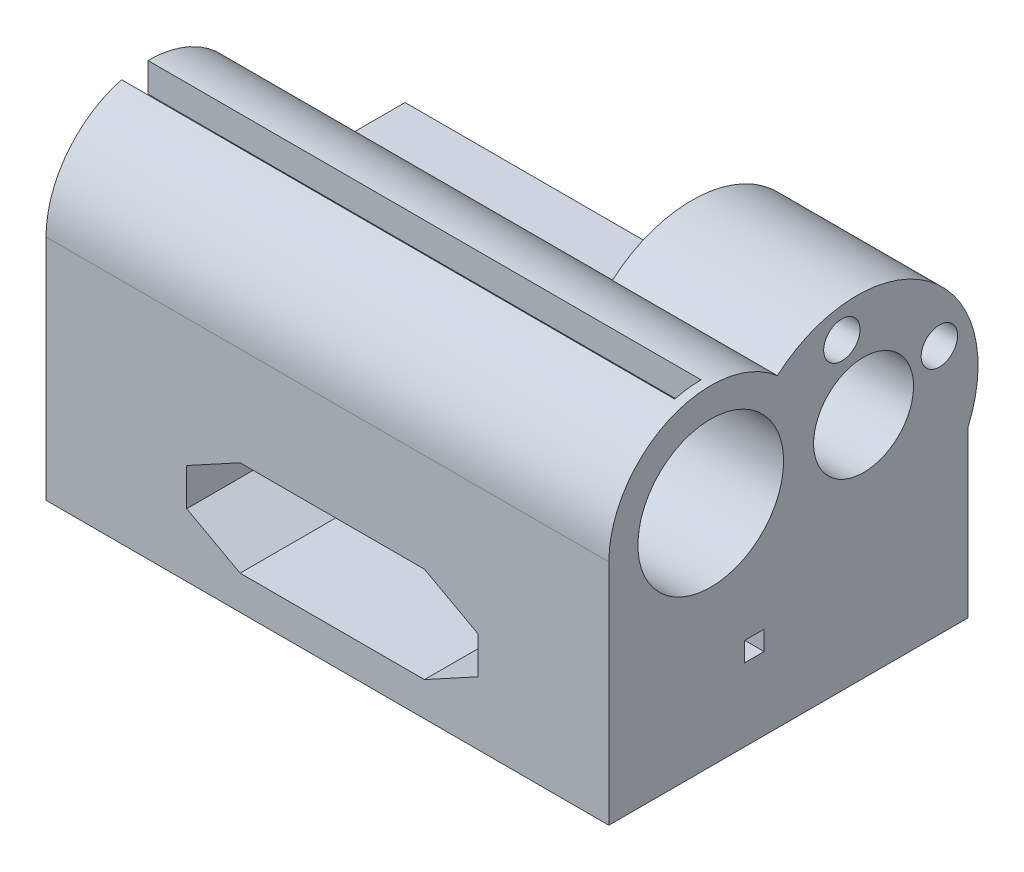
ISO-10303-21;
HEADER;
FILE_DESCRIPTION(('STEP AP214'),'2;1');
FILE_NAME('part.step','',(''),(''),'','','');
FILE_SCHEMA(('AUTOMOTIVE_DESIGN { 1 0 10303 214 1 1 1 1 }'));
ENDSEC;
DATA;
#1=APPLICATION_CONTEXT('core data for automotive mechanical design processes');
#2=APPLICATION_PROTOCOL_DEFINITION('international standard','automotive_design',2000,#1);
#3=PRODUCT_CONTEXT('',#1,'mechanical');
#4=PRODUCT('Part','Part','',(#3));
#5=PRODUCT_RELATED_PRODUCT_CATEGORY('part','',(#4));
#6=PRODUCT_DEFINITION_FORMATION('','',#4);
#7=PRODUCT_DEFINITION_CONTEXT('part definition',#1,'design');
#8=PRODUCT_DEFINITION('design','',#6,#7);
#9=PRODUCT_DEFINITION_SHAPE('','',#8);
#10=(LENGTH_UNIT() NAMED_UNIT(*) SI_UNIT(.MILLI.,.METRE.));
#11=(NAMED_UNIT(*) PLANE_ANGLE_UNIT() SI_UNIT($,.RADIAN.));
#12=(NAMED_UNIT(*) SI_UNIT($,.STERADIAN.) SOLID_ANGLE_UNIT());
#13=UNCERTAINTY_MEASURE_WITH_UNIT(LENGTH_MEASURE(1.E-05),#10,'distance_accuracy_value','');
#14=(GEOMETRIC_REPRESENTATION_CONTEXT(3) GLOBAL_UNCERTAINTY_ASSIGNED_CONTEXT((#13)) GLOBAL_UNIT_ASSIGNED_CONTEXT((#10,
#11,#12)) REPRESENTATION_CONTEXT('',''));
#15=CARTESIAN_POINT('',(0.,0.,0.));
#16=DIRECTION('',(0.,0.,1.));
#17=DIRECTION('',(1.,0.,0.));
#18=AXIS2_PLACEMENT_3D('',#15,#16,#17);
#19=CARTESIAN_POINT('',(29.,17.,18.5));
#20=DIRECTION('',(-1.,0.,0.));
#21=DIRECTION('',(0.,0.,1.));
#22=AXIS2_PLACEMENT_3D('',#19,#20,#21);
#23=PLANE('',#22);
#24=DIRECTION('',(0.,-1.,0.));
#25=VECTOR('',#24,1.);
#26=CARTESIAN_POINT('',(29.,17.,-18.5));
#27=LINE('',#26,#25);
#28=CARTESIAN_POINT('',(29.,17.,-18.5));
#29=VERTEX_POINT('',#28);
#30=CARTESIAN_POINT('',(29.,0.,-18.5));
#31=VERTEX_POINT('',#30);
#32=EDGE_CURVE('E442',#29,#31,#27,.T.);
#33=ORIENTED_EDGE('',*,*,#32,.F.);
#34=CARTESIAN_POINT('',(29.,22.,-7.04356076261039));
#35=DIRECTION('',(1.,0.,0.));
#36=DIRECTION('',(0.,0.,-1.));
#37=AXIS2_PLACEMENT_3D('',#34,#35,#36);
#38=CIRCLE('',#37,12.5);
#39=CARTESIAN_POINT('',(29.,31.4490069740523,1.1397311913841));
#40=VERTEX_POINT('',#39);
#41=EDGE_CURVE('E377',#29,#40,#38,.T.);
#42=ORIENTED_EDGE('',*,*,#41,.T.);
#43=CARTESIAN_POINT('',(29.,23.5,8.));
#44=DIRECTION('',(1.,0.,0.));
#45=DIRECTION('',(0.,0.,-1.));
#46=AXIS2_PLACEMENT_3D('',#43,#44,#45);
#47=CIRCLE('',#46,10.5);
#48=CARTESIAN_POINT('',(29.,23.5,18.5));
#49=VERTEX_POINT('',#48);
#50=EDGE_CURVE('E402',#40,#49,#47,.T.);
#51=ORIENTED_EDGE('',*,*,#50,.T.);
#52=DIRECTION('',(0.,-1.,0.));
#53=VECTOR('',#52,1.);
#54=CARTESIAN_POINT('',(29.,17.,18.5));
#55=LINE('',#54,#53);
#56=CARTESIAN_POINT('',(29.,0.,18.5));
#57=VERTEX_POINT('',#56);
#58=EDGE_CURVE('E425',#49,#57,#55,.T.);
#59=ORIENTED_EDGE('',*,*,#58,.T.);
#60=DIRECTION('',(0.,0.,-1.));
#61=VECTOR('',#60,1.);
#62=CARTESIAN_POINT('',(29.,0.,18.5));
#63=LINE('',#62,#61);
#64=EDGE_CURVE('E409',#57,#31,#63,.T.);
#65=ORIENTED_EDGE('',*,*,#64,.T.);
#66=EDGE_LOOP('',(#33,#42,#51,#59,#65));
#67=FACE_BOUND('',#66,.T.);
#68=CARTESIAN_POINT('',(29.,23.5,-7.7501439));
#69=DIRECTION('',(1.,0.,0.));
#70=DIRECTION('',(0.,0.,-1.));
#71=AXIS2_PLACEMENT_3D('',#68,#69,#70);
#72=CIRCLE('',#71,5.15);
#73=CARTESIAN_POINT('',(29.,23.5,-12.9001439));
#74=VERTEX_POINT('',#73);
#75=EDGE_CURVE('E311',#74,#74,#72,.T.);
#76=ORIENTED_EDGE('',*,*,#75,.F.);
#77=EDGE_LOOP('',(#76));
#78=FACE_BOUND('',#77,.T.);
#79=CARTESIAN_POINT('',(29.,23.5,8.));
#80=DIRECTION('',(1.,0.,0.));
#81=DIRECTION('',(0.,0.,-1.));
#82=AXIS2_PLACEMENT_3D('',#79,#80,#81);
#83=CIRCLE('',#82,7.5075);
#84=CARTESIAN_POINT('',(29.,23.5,0.492500000000002));
#85=VERTEX_POINT('',#84);
#86=EDGE_CURVE('E308',#85,#85,#83,.T.);
#87=ORIENTED_EDGE('',*,*,#86,.F.);
#88=EDGE_LOOP('',(#87));
#89=FACE_BOUND('',#88,.T.);
#90=CARTESIAN_POINT('',(29.,25.7404904729143,-15.5601264506066));
#91=DIRECTION('',(1.,0.,0.));
#92=DIRECTION('',(0.,0.,-1.));
#93=AXIS2_PLACEMENT_3D('',#90,#91,#92);
#94=CIRCLE('',#93,1.87500000000001);
#95=CARTESIAN_POINT('',(29.,25.7404904729143,-17.4351264506067));
#96=VERTEX_POINT('',#95);
#97=EDGE_CURVE('E297',#96,#96,#94,.T.);
#98=ORIENTED_EDGE('',*,*,#97,.F.);
#99=EDGE_LOOP('',(#98));
#100=FACE_BOUND('',#99,.T.);
#101=CARTESIAN_POINT('',(29.,31.3099825506067,-5.50965342708572));
#102=DIRECTION('',(1.,0.,0.));
#103=DIRECTION('',(0.,0.,-1.));
#104=AXIS2_PLACEMENT_3D('',#101,#102,#103);
#105=CIRCLE('',#104,1.875);
#106=CARTESIAN_POINT('',(29.,31.3099825506067,-7.38465342708572));
#107=VERTEX_POINT('',#106);
#108=EDGE_CURVE('E298',#107,#107,#105,.T.);
#109=ORIENTED_EDGE('',*,*,#108,.F.);
#110=EDGE_LOOP('',(#109));
#111=FACE_BOUND('',#110,.T.);
#112=DIRECTION('',(0.,1.,0.));
#113=VECTOR('',#112,1.);
#114=CARTESIAN_POINT('',(29.,7.5,4.5));
#115=LINE('',#114,#113);
#116=CARTESIAN_POINT('',(29.,7.5,4.5));
#117=VERTEX_POINT('',#116);
#118=CARTESIAN_POINT('',(29.,9.5,4.5));
#119=VERTEX_POINT('',#118);
#120=EDGE_CURVE('E61',#117,#119,#115,.T.);
#121=ORIENTED_EDGE('',*,*,#120,.T.);
#122=DIRECTION('',(0.,0.,-1.));
#123=VECTOR('',#122,1.);
#124=CARTESIAN_POINT('',(29.,9.5,4.5));
#125=LINE('',#124,#123);
#126=CARTESIAN_POINT('',(29.,9.5,2.5));
#127=VERTEX_POINT('',#126);
#128=EDGE_CURVE('E256',#119,#127,#125,.T.);
#129=ORIENTED_EDGE('',*,*,#128,.T.);
#130=DIRECTION('',(0.,-1.,0.));
#131=VECTOR('',#130,1.);
#132=CARTESIAN_POINT('',(29.,7.5,2.5));
#133=LINE('',#132,#131);
#134=CARTESIAN_POINT('',(29.,7.5,2.5));
#135=VERTEX_POINT('',#134);
#136=EDGE_CURVE('E253',#127,#135,#133,.T.);
#137=ORIENTED_EDGE('',*,*,#136,.T.);
#138=DIRECTION('',(0.,0.,1.));
#139=VECTOR('',#138,1.);
#140=CARTESIAN_POINT('',(29.,7.5,4.5));
#141=LINE('',#140,#139);
#142=EDGE_CURVE('E249',#135,#117,#141,.T.);
#143=ORIENTED_EDGE('',*,*,#142,.T.);
#144=EDGE_LOOP('',(#121,#129,#137,#143));
#145=FACE_BOUND('',#144,.T.);
#146=ADVANCED_FACE('F38',(#67,#78,#89,#100,#111,#145),#23,.F.);
#147=CARTESIAN_POINT('',(23.,8.5,4.5));
#148=DIRECTION('',(0.,0.,-1.));
#149=DIRECTION('',(-1.,0.,0.));
#150=AXIS2_PLACEMENT_3D('',#147,#148,#149);
#151=CYLINDRICAL_SURFACE('',#150,4.076);
#152=CARTESIAN_POINT('',(23.,8.5,-18.5));
#153=DIRECTION('',(0.,0.,-1.));
#154=DIRECTION('',(-1.,0.,0.));
#155=AXIS2_PLACEMENT_3D('',#152,#153,#154);
#156=CIRCLE('',#155,4.076);
#157=CARTESIAN_POINT('',(18.924,8.5,-18.5));
#158=VERTEX_POINT('',#157);
#159=EDGE_CURVE('E319',#158,#158,#156,.T.);
#160=ORIENTED_EDGE('',*,*,#159,.T.);
#161=EDGE_LOOP('',(#160));
#162=FACE_BOUND('',#161,.T.);
#163=DIRECTION('',(0.,0.,-1.));
#164=VECTOR('',#163,1.);
#165=CARTESIAN_POINT('',(26.9514270839787,9.5,4.5));
#166=LINE('',#165,#164);
#167=CARTESIAN_POINT('',(26.9514270839787,9.5,4.5));
#168=VERTEX_POINT('',#167);
#169=CARTESIAN_POINT('',(26.9514270839787,9.5,2.5));
#170=VERTEX_POINT('',#169);
#171=EDGE_CURVE('E269',#168,#170,#166,.T.);
#172=ORIENTED_EDGE('',*,*,#171,.F.);
#173=CARTESIAN_POINT('',(23.,8.5,4.5));
#174=DIRECTION('',(0.,0.,-1.));
#175=DIRECTION('',(-1.,0.,0.));
#176=AXIS2_PLACEMENT_3D('',#173,#174,#175);
#177=CIRCLE('',#176,4.076);
#178=CARTESIAN_POINT('',(26.9514270839787,7.5,4.5));
#179=VERTEX_POINT('',#178);
#180=EDGE_CURVE('E315',#179,#168,#177,.T.);
#181=ORIENTED_EDGE('',*,*,#180,.F.);
#182=DIRECTION('',(0.,0.,-1.));
#183=VECTOR('',#182,1.);
#184=CARTESIAN_POINT('',(26.9514270839787,7.5,4.5));
#185=LINE('',#184,#183);
#186=CARTESIAN_POINT('',(26.9514270839787,7.5,2.5));
#187=VERTEX_POINT('',#186);
#188=EDGE_CURVE('E262',#187,#179,#185,.F.);
#189=ORIENTED_EDGE('',*,*,#188,.F.);
#190=CARTESIAN_POINT('',(23.,8.5,2.5));
#191=DIRECTION('',(0.,0.,1.));
#192=DIRECTION('',(1.,0.,0.));
#193=AXIS2_PLACEMENT_3D('',#190,#191,#192);
#194=CIRCLE('',#193,4.076);
#195=EDGE_CURVE('E12',#170,#187,#194,.F.);
#196=ORIENTED_EDGE('',*,*,#195,.F.);
#197=EDGE_LOOP('',(#172,#181,#189,#196));
#198=FACE_BOUND('',#197,.T.);
#199=ADVANCED_FACE('F523',(#162,#198),#151,.F.);
#200=CARTESIAN_POINT('',(0.,17.,0.));
#201=DIRECTION('',(0.,-1.,0.));
#202=DIRECTION('',(0.,0.,-1.));
#203=AXIS2_PLACEMENT_3D('',#200,#201,#202);
#204=PLANE('',#203);
#205=CARTESIAN_POINT('',(0.500000000000004,17.,-11.5));
#206=DIRECTION('',(0.,-1.,0.));
#207=DIRECTION('',(0.,0.,-1.));
#208=AXIS2_PLACEMENT_3D('',#205,#206,#207);
#209=CIRCLE('',#208,1.5);
#210=CARTESIAN_POINT('',(0.500000000000004,17.,-13.));
#211=VERTEX_POINT('',#210);
#212=EDGE_CURVE('E917',#211,#211,#209,.T.);
#213=ORIENTED_EDGE('',*,*,#212,.T.);
#214=EDGE_LOOP('',(#213));
#215=FACE_BOUND('',#214,.T.);
#216=DIRECTION('',(0.,0.,1.));
#217=VECTOR('',#216,1.);
#218=CARTESIAN_POINT('',(12.,17.,0.));
#219=LINE('',#218,#217);
#220=CARTESIAN_POINT('',(12.,17.,-18.5));
#221=VERTEX_POINT('',#220);
#222=CARTESIAN_POINT('',(12.,17.,-2.5));
#223=VERTEX_POINT('',#222);
#224=EDGE_CURVE('E400',#221,#223,#219,.T.);
#225=ORIENTED_EDGE('',*,*,#224,.F.);
#226=DIRECTION('',(-1.,0.,0.));
#227=VECTOR('',#226,1.);
#228=CARTESIAN_POINT('',(-29.,17.,-18.5));
#229=LINE('',#228,#227);
#230=CARTESIAN_POINT('',(-29.,17.,-18.5));
#231=VERTEX_POINT('',#230);
#232=EDGE_CURVE('E422',#221,#231,#229,.T.);
#233=ORIENTED_EDGE('',*,*,#232,.T.);
#234=DIRECTION('',(0.,0.,1.));
#235=VECTOR('',#234,1.);
#236=CARTESIAN_POINT('',(-29.,17.,18.5));
#237=LINE('',#236,#235);
#238=CARTESIAN_POINT('',(-29.,17.,-2.5));
#239=VERTEX_POINT('',#238);
#240=EDGE_CURVE('E421',#231,#239,#237,.T.);
#241=ORIENTED_EDGE('',*,*,#240,.T.);
#242=DIRECTION('',(1.,0.,0.));
#243=VECTOR('',#242,1.);
#244=CARTESIAN_POINT('',(-56.0185121722126,17.,-2.5));
#245=LINE('',#244,#243);
#246=EDGE_CURVE('E414',#239,#223,#245,.T.);
#247=ORIENTED_EDGE('',*,*,#246,.T.);
#248=EDGE_LOOP('',(#225,#233,#241,#247));
#249=FACE_BOUND('',#248,.T.);
#250=ADVANCED_FACE('F510',(#215,#249),#204,.F.);
#251=CARTESIAN_POINT('',(-56.0185121722126,23.5,-2.5));
#252=DIRECTION('',(0.,0.,-1.));
#253=DIRECTION('',(-1.,0.,0.));
#254=AXIS2_PLACEMENT_3D('',#251,#252,#253);
#255=PLANE('',#254);
#256=DIRECTION('',(1.,0.,0.));
#257=VECTOR('',#256,1.);
#258=CARTESIAN_POINT('',(-56.0185121722126,23.5,-2.5));
#259=LINE('',#258,#257);
#260=CARTESIAN_POINT('',(-29.,23.5,-2.5));
#261=VERTEX_POINT('',#260);
#262=CARTESIAN_POINT('',(12.,23.5,-2.5));
#263=VERTEX_POINT('',#262);
#264=EDGE_CURVE('E405',#261,#263,#259,.T.);
#265=ORIENTED_EDGE('',*,*,#264,.T.);
#266=DIRECTION('',(0.,-1.,0.));
#267=VECTOR('',#266,1.);
#268=CARTESIAN_POINT('',(12.,23.5,-2.5));
#269=LINE('',#268,#267);
#270=EDGE_CURVE('E445',#263,#223,#269,.T.);
#271=ORIENTED_EDGE('',*,*,#270,.T.);
#272=ORIENTED_EDGE('',*,*,#246,.F.);
#273=DIRECTION('',(0.,-1.,0.));
#274=VECTOR('',#273,1.);
#275=CARTESIAN_POINT('',(-29.,23.5,-2.5));
#276=LINE('',#275,#274);
#277=EDGE_CURVE('E403',#261,#239,#276,.T.);
#278=ORIENTED_EDGE('',*,*,#277,.F.);
#279=EDGE_LOOP('',(#265,#271,#272,#278));
#280=FACE_BOUND('',#279,.T.);
#281=ADVANCED_FACE('F515',(#280),#255,.T.);
#282=CARTESIAN_POINT('',(-29.,17.,-18.5));
#283=DIRECTION('',(0.,0.,1.));
#284=DIRECTION('',(1.,0.,0.));
#285=AXIS2_PLACEMENT_3D('',#282,#283,#284);
#286=PLANE('',#285);
#287=ORIENTED_EDGE('',*,*,#159,.F.);
#288=EDGE_LOOP('',(#287));
#289=FACE_BOUND('',#288,.T.);
#290=CARTESIAN_POINT('',(-22.,8.5,-18.5));
#291=DIRECTION('',(0.,0.,-1.));
#292=DIRECTION('',(-1.,0.,0.));
#293=AXIS2_PLACEMENT_3D('',#290,#291,#292);
#294=CIRCLE('',#293,4.076);
#295=CARTESIAN_POINT('',(-26.076,8.5,-18.5));
#296=VERTEX_POINT('',#295);
#297=EDGE_CURVE('E325',#296,#296,#294,.T.);
#298=ORIENTED_EDGE('',*,*,#297,.F.);
#299=EDGE_LOOP('',(#298));
#300=FACE_BOUND('',#299,.T.);
#301=DIRECTION('',(-1.,0.,0.));
#302=VECTOR('',#301,1.);
#303=CARTESIAN_POINT('',(-8.99999999999999,3.5,-18.5));
#304=LINE('',#303,#302);
#305=CARTESIAN_POINT('',(10.,3.5,-18.5));
#306=VERTEX_POINT('',#305);
#307=CARTESIAN_POINT('',(-8.99999999999999,3.5,-18.5));
#308=VERTEX_POINT('',#307);
#309=EDGE_CURVE('E355',#306,#308,#304,.T.);
#310=ORIENTED_EDGE('',*,*,#309,.F.);
#311=DIRECTION('',(-0.877895572914384,-0.478852130680573,0.));
#312=VECTOR('',#311,1.);
#313=CARTESIAN_POINT('',(10.,3.5,-18.5));
#314=LINE('',#313,#312);
#315=CARTESIAN_POINT('',(15.5,6.5,-18.5));
#316=VERTEX_POINT('',#315);
#317=EDGE_CURVE('E318',#316,#306,#314,.T.);
#318=ORIENTED_EDGE('',*,*,#317,.F.);
#319=DIRECTION('',(0.,-1.,0.));
#320=VECTOR('',#319,1.);
#321=CARTESIAN_POINT('',(15.5,6.5,-18.5));
#322=LINE('',#321,#320);
#323=CARTESIAN_POINT('',(15.5,10.35,-18.5));
#324=VERTEX_POINT('',#323);
#325=EDGE_CURVE('E332',#324,#316,#322,.T.);
#326=ORIENTED_EDGE('',*,*,#325,.F.);
#327=DIRECTION('',(0.877895572914384,-0.478852130680573,0.));
#328=VECTOR('',#327,1.);
#329=CARTESIAN_POINT('',(15.5,10.35,-18.5));
#330=LINE('',#329,#328);
#331=CARTESIAN_POINT('',(10.,13.35,-18.5));
#332=VERTEX_POINT('',#331);
#333=EDGE_CURVE('E370',#332,#324,#330,.T.);
#334=ORIENTED_EDGE('',*,*,#333,.F.);
#335=DIRECTION('',(1.,0.,0.));
#336=VECTOR('',#335,1.);
#337=CARTESIAN_POINT('',(10.,13.35,-18.5));
#338=LINE('',#337,#336);
#339=CARTESIAN_POINT('',(-9.00000000000001,13.35,-18.5));
#340=VERTEX_POINT('',#339);
#341=EDGE_CURVE('E367',#340,#332,#338,.T.);
#342=ORIENTED_EDGE('',*,*,#341,.F.);
#343=DIRECTION('',(0.878365103433168,0.477990319013723,0.));
#344=VECTOR('',#343,1.);
#345=CARTESIAN_POINT('',(-9.00000000000001,13.35,-18.5));
#346=LINE('',#345,#344);
#347=CARTESIAN_POINT('',(-14.5,10.357,-18.5));
#348=VERTEX_POINT('',#347);
#349=EDGE_CURVE('E364',#348,#340,#346,.T.);
#350=ORIENTED_EDGE('',*,*,#349,.F.);
#351=DIRECTION('',(0.,1.,0.));
#352=VECTOR('',#351,1.);
#353=CARTESIAN_POINT('',(-14.5,10.357,-18.5));
#354=LINE('',#353,#352);
#355=CARTESIAN_POINT('',(-14.5,6.5,-18.5));
#356=VERTEX_POINT('',#355);
#357=EDGE_CURVE('E361',#356,#348,#354,.T.);
#358=ORIENTED_EDGE('',*,*,#357,.F.);
#359=DIRECTION('',(-0.877895572914384,0.478852130680573,0.));
#360=VECTOR('',#359,1.);
#361=CARTESIAN_POINT('',(-14.5,6.5,-18.5));
#362=LINE('',#361,#360);
#363=EDGE_CURVE('E358',#308,#356,#362,.T.);
#364=ORIENTED_EDGE('',*,*,#363,.F.);
#365=EDGE_LOOP('',(#310,#318,#326,#334,#342,#350,#358,#364));
#366=FACE_BOUND('',#365,.T.);
#367=DIRECTION('',(-1.,0.,0.));
#368=VECTOR('',#367,1.);
#369=CARTESIAN_POINT('',(-29.,0.,-18.5));
#370=LINE('',#369,#368);
#371=CARTESIAN_POINT('',(-29.,0.,-18.5));
#372=VERTEX_POINT('',#371);
#373=EDGE_CURVE('E428',#31,#372,#370,.T.);
#374=ORIENTED_EDGE('',*,*,#373,.T.);
#375=DIRECTION('',(0.,-1.,0.));
#376=VECTOR('',#375,1.);
#377=CARTESIAN_POINT('',(-29.,17.,-18.5));
#378=LINE('',#377,#376);
#379=EDGE_CURVE('E439',#231,#372,#378,.T.);
#380=ORIENTED_EDGE('',*,*,#379,.F.);
#381=ORIENTED_EDGE('',*,*,#232,.F.);
#382=EDGE_CURVE('E419',#29,#221,#229,.T.);
#383=ORIENTED_EDGE('',*,*,#382,.F.);
#384=ORIENTED_EDGE('',*,*,#32,.T.);
#385=EDGE_LOOP('',(#374,#380,#381,#383,#384));
#386=FACE_BOUND('',#385,.T.);
#387=ADVANCED_FACE('F481',(#289,#300,#366,#386),#286,.F.);
#388=CARTESIAN_POINT('',(-29.,17.,18.5));
#389=DIRECTION('',(1.,0.,0.));
#390=DIRECTION('',(0.,0.,-1.));
#391=AXIS2_PLACEMENT_3D('',#388,#389,#390);
#392=PLANE('',#391);
#393=DIRECTION('',(0.,0.,-1.));
#394=VECTOR('',#393,1.);
#395=CARTESIAN_POINT('',(-29.,9.5,4.5));
#396=LINE('',#395,#394);
#397=CARTESIAN_POINT('',(-29.,9.5,4.5));
#398=VERTEX_POINT('',#397);
#399=CARTESIAN_POINT('',(-29.,9.5,2.5));
#400=VERTEX_POINT('',#399);
#401=EDGE_CURVE('E273',#398,#400,#396,.T.);
#402=ORIENTED_EDGE('',*,*,#401,.F.);
#403=DIRECTION('',(0.,1.,0.));
#404=VECTOR('',#403,1.);
#405=CARTESIAN_POINT('',(-29.,7.5,4.5));
#406=LINE('',#405,#404);
#407=CARTESIAN_POINT('',(-29.,7.5,4.5));
#408=VERTEX_POINT('',#407);
#409=EDGE_CURVE('E271',#408,#398,#406,.T.);
#410=ORIENTED_EDGE('',*,*,#409,.F.);
#411=DIRECTION('',(0.,0.,1.));
#412=VECTOR('',#411,1.);
#413=CARTESIAN_POINT('',(-29.,7.5,4.5));
#414=LINE('',#413,#412);
#415=CARTESIAN_POINT('',(-29.,7.5,2.5));
#416=VERTEX_POINT('',#415);
#417=EDGE_CURVE('E279',#416,#408,#414,.T.);
#418=ORIENTED_EDGE('',*,*,#417,.F.);
#419=DIRECTION('',(0.,-1.,0.));
#420=VECTOR('',#419,1.);
#421=CARTESIAN_POINT('',(-29.,7.5,2.5));
#422=LINE('',#421,#420);
#423=EDGE_CURVE('E276',#400,#416,#422,.T.);
#424=ORIENTED_EDGE('',*,*,#423,.F.);
#425=EDGE_LOOP('',(#402,#410,#418,#424));
#426=FACE_BOUND('',#425,.T.);
#427=CARTESIAN_POINT('',(-29.,23.5,8.));
#428=DIRECTION('',(1.,0.,0.));
#429=DIRECTION('',(0.,0.,-1.));
#430=AXIS2_PLACEMENT_3D('',#427,#428,#429);
#431=CIRCLE('',#430,10.5);
#432=CARTESIAN_POINT('',(-29.,23.5,18.5));
#433=VERTEX_POINT('',#432);
#434=CARTESIAN_POINT('',(-29.,33.6422211760352,10.7175999735764));
#435=VERTEX_POINT('',#434);
#436=EDGE_CURVE('E406',#433,#435,#431,.F.);
#437=ORIENTED_EDGE('',*,*,#436,.T.);
#438=DIRECTION('',(0.,0.965925826289069,0.258819045102517));
#439=VECTOR('',#438,1.);
#440=CARTESIAN_POINT('',(-29.,-0.425798494467172,1.58910161513784));
#441=LINE('',#440,#439);
#442=CARTESIAN_POINT('',(-29.,30.7516881408652,9.94308398110716));
#443=VERTEX_POINT('',#442);
#444=EDGE_CURVE('E236',#443,#435,#441,.T.);
#445=ORIENTED_EDGE('',*,*,#444,.F.);
#446=CARTESIAN_POINT('',(-29.,23.5,8.));
#447=DIRECTION('',(1.,0.,0.));
#448=DIRECTION('',(0.,0.,-1.));
#449=AXIS2_PLACEMENT_3D('',#446,#447,#448);
#450=CIRCLE('',#449,7.5075);
#451=CARTESIAN_POINT('',(-29.,31.0075,8.00000000000003));
#452=VERTEX_POINT('',#451);
#453=EDGE_CURVE('E304',#443,#452,#450,.T.);
#454=ORIENTED_EDGE('',*,*,#453,.T.);
#455=DIRECTION('',(0.,-1.,0.));
#456=VECTOR('',#455,1.);
#457=CARTESIAN_POINT('',(-29.,0.,7.99999999999992));
#458=LINE('',#457,#456);
#459=CARTESIAN_POINT('',(-29.,34.,8.00000000000004));
#460=VERTEX_POINT('',#459);
#461=EDGE_CURVE('E916',#460,#452,#458,.T.);
#462=ORIENTED_EDGE('',*,*,#461,.F.);
#463=EDGE_CURVE('E241',#460,#261,#431,.F.);
#464=ORIENTED_EDGE('',*,*,#463,.T.);
#465=ORIENTED_EDGE('',*,*,#277,.T.);
#466=ORIENTED_EDGE('',*,*,#240,.F.);
#467=ORIENTED_EDGE('',*,*,#379,.T.);
#468=DIRECTION('',(0.,0.,1.));
#469=VECTOR('',#468,1.);
#470=CARTESIAN_POINT('',(-29.,0.,18.5));
#471=LINE('',#470,#469);
#472=CARTESIAN_POINT('',(-29.,0.,18.5));
#473=VERTEX_POINT('',#472);
#474=EDGE_CURVE('E430',#372,#473,#471,.T.);
#475=ORIENTED_EDGE('',*,*,#474,.T.);
#476=DIRECTION('',(0.,-1.,0.));
#477=VECTOR('',#476,1.);
#478=CARTESIAN_POINT('',(-29.,17.,18.5));
#479=LINE('',#478,#477);
#480=EDGE_CURVE('E436',#433,#473,#479,.T.);
#481=ORIENTED_EDGE('',*,*,#480,.F.);
#482=EDGE_LOOP('',(#437,#445,#454,#462,#464,#465,#466,#467,#475,#481));
#483=FACE_BOUND('',#482,.T.);
#484=ADVANCED_FACE('F477',(#426,#483),#392,.F.);
#485=CARTESIAN_POINT('',(-29.,17.,18.5));
#486=DIRECTION('',(0.,0.,-1.));
#487=DIRECTION('',(-1.,0.,0.));
#488=AXIS2_PLACEMENT_3D('',#485,#486,#487);
#489=PLANE('',#488);
#490=DIRECTION('',(0.,-1.,0.));
#491=VECTOR('',#490,1.);
#492=CARTESIAN_POINT('',(15.5,6.5,18.5));
#493=LINE('',#492,#491);
#494=CARTESIAN_POINT('',(15.5,10.35,18.5));
#495=VERTEX_POINT('',#494);
#496=CARTESIAN_POINT('',(15.5,6.5,18.5));
#497=VERTEX_POINT('',#496);
#498=EDGE_CURVE('E350',#495,#497,#493,.T.);
#499=ORIENTED_EDGE('',*,*,#498,.T.);
#500=DIRECTION('',(-0.877895572914384,-0.478852130680573,0.));
#501=VECTOR('',#500,1.);
#502=CARTESIAN_POINT('',(10.,3.5,18.5));
#503=LINE('',#502,#501);
#504=CARTESIAN_POINT('',(10.,3.5,18.5));
#505=VERTEX_POINT('',#504);
#506=EDGE_CURVE('E328',#497,#505,#503,.T.);
#507=ORIENTED_EDGE('',*,*,#506,.T.);
#508=DIRECTION('',(-1.,0.,0.));
#509=VECTOR('',#508,1.);
#510=CARTESIAN_POINT('',(-8.99999999999999,3.5,18.5));
#511=LINE('',#510,#509);
#512=CARTESIAN_POINT('',(-8.99999999999999,3.5,18.5));
#513=VERTEX_POINT('',#512);
#514=EDGE_CURVE('E331',#505,#513,#511,.T.);
#515=ORIENTED_EDGE('',*,*,#514,.T.);
#516=DIRECTION('',(-0.877895572914384,0.478852130680573,0.));
#517=VECTOR('',#516,1.);
#518=CARTESIAN_POINT('',(-14.5,6.5,18.5));
#519=LINE('',#518,#517);
#520=CARTESIAN_POINT('',(-14.5,6.5,18.5));
#521=VERTEX_POINT('',#520);
#522=EDGE_CURVE('E335',#513,#521,#519,.T.);
#523=ORIENTED_EDGE('',*,*,#522,.T.);
#524=DIRECTION('',(0.,1.,0.));
#525=VECTOR('',#524,1.);
#526=CARTESIAN_POINT('',(-14.5,10.357,18.5));
#527=LINE('',#526,#525);
#528=CARTESIAN_POINT('',(-14.5,10.357,18.5));
#529=VERTEX_POINT('',#528);
#530=EDGE_CURVE('E338',#521,#529,#527,.T.);
#531=ORIENTED_EDGE('',*,*,#530,.T.);
#532=DIRECTION('',(0.878365103433168,0.477990319013723,0.));
#533=VECTOR('',#532,1.);
#534=CARTESIAN_POINT('',(-9.00000000000001,13.35,18.5));
#535=LINE('',#534,#533);
#536=CARTESIAN_POINT('',(-9.00000000000001,13.35,18.5));
#537=VERTEX_POINT('',#536);
#538=EDGE_CURVE('E341',#529,#537,#535,.T.);
#539=ORIENTED_EDGE('',*,*,#538,.T.);
#540=DIRECTION('',(1.,0.,0.));
#541=VECTOR('',#540,1.);
#542=CARTESIAN_POINT('',(10.,13.35,18.5));
#543=LINE('',#542,#541);
#544=CARTESIAN_POINT('',(10.,13.35,18.5));
#545=VERTEX_POINT('',#544);
#546=EDGE_CURVE('E344',#537,#545,#543,.T.);
#547=ORIENTED_EDGE('',*,*,#546,.T.);
#548=DIRECTION('',(0.877895572914384,-0.478852130680573,0.));
#549=VECTOR('',#548,1.);
#550=CARTESIAN_POINT('',(15.5,10.35,18.5));
#551=LINE('',#550,#549);
#552=EDGE_CURVE('E347',#545,#495,#551,.T.);
#553=ORIENTED_EDGE('',*,*,#552,.T.);
#554=EDGE_LOOP('',(#499,#507,#515,#523,#531,#539,#547,#553));
#555=FACE_BOUND('',#554,.T.);
#556=DIRECTION('',(1.,0.,0.));
#557=VECTOR('',#556,1.);
#558=CARTESIAN_POINT('',(-29.,0.,18.5));
#559=LINE('',#558,#557);
#560=EDGE_CURVE('E432',#473,#57,#559,.T.);
#561=ORIENTED_EDGE('',*,*,#560,.T.);
#562=ORIENTED_EDGE('',*,*,#58,.F.);
#563=DIRECTION('',(1.,0.,0.));
#564=VECTOR('',#563,1.);
#565=CARTESIAN_POINT('',(-56.0185121722126,23.5,18.5));
#566=LINE('',#565,#564);
#567=EDGE_CURVE('E411',#433,#49,#566,.T.);
#568=ORIENTED_EDGE('',*,*,#567,.F.);
#569=ORIENTED_EDGE('',*,*,#480,.T.);
#570=EDGE_LOOP('',(#561,#562,#568,#569));
#571=FACE_BOUND('',#570,.T.);
#572=ADVANCED_FACE('F480',(#555,#571),#489,.F.);
#573=CARTESIAN_POINT('',(0.,0.,0.));
#574=DIRECTION('',(0.,-1.,0.));
#575=DIRECTION('',(0.,0.,-1.));
#576=AXIS2_PLACEMENT_3D('',#573,#574,#575);
#577=PLANE('',#576);
#578=CARTESIAN_POINT('',(0.500000000000004,0.,-11.5));
#579=DIRECTION('',(0.,-1.,0.));
#580=DIRECTION('',(0.,0.,-1.));
#581=AXIS2_PLACEMENT_3D('',#578,#579,#580);
#582=CIRCLE('',#581,1.5);
#583=CARTESIAN_POINT('',(0.500000000000004,0.,-13.));
#584=VERTEX_POINT('',#583);
#585=EDGE_CURVE('E928',#584,#584,#582,.T.);
#586=ORIENTED_EDGE('',*,*,#585,.F.);
#587=EDGE_LOOP('',(#586));
#588=FACE_BOUND('',#587,.T.);
#589=ORIENTED_EDGE('',*,*,#64,.F.);
#590=ORIENTED_EDGE('',*,*,#560,.F.);
#591=ORIENTED_EDGE('',*,*,#474,.F.);
#592=ORIENTED_EDGE('',*,*,#373,.F.);
#593=EDGE_LOOP('',(#589,#590,#591,#592));
#594=FACE_BOUND('',#593,.T.);
#595=ADVANCED_FACE('F496',(#588,#594),#577,.T.);
#596=CARTESIAN_POINT('',(-56.0185121722126,23.5,8.));
#597=DIRECTION('',(1.,0.,0.));
#598=DIRECTION('',(0.,0.,-1.));
#599=AXIS2_PLACEMENT_3D('',#596,#597,#598);
#600=CYLINDRICAL_SURFACE('',#599,10.5);
#601=DIRECTION('',(-1.,0.,0.));
#602=VECTOR('',#601,1.);
#603=CARTESIAN_POINT('',(28.,33.6422211760352,10.7175999735764));
#604=LINE('',#603,#602);
#605=CARTESIAN_POINT('',(28.,33.6422211760352,10.7175999735764));
#606=VERTEX_POINT('',#605);
#607=EDGE_CURVE('E250',#606,#435,#604,.T.);
#608=ORIENTED_EDGE('',*,*,#607,.T.);
#609=ORIENTED_EDGE('',*,*,#436,.F.);
#610=ORIENTED_EDGE('',*,*,#567,.T.);
#611=ORIENTED_EDGE('',*,*,#50,.F.);
#612=DIRECTION('',(1.,0.,0.));
#613=VECTOR('',#612,1.);
#614=CARTESIAN_POINT('',(20.5,31.4490069740523,1.13973119138409));
#615=LINE('',#614,#613);
#616=CARTESIAN_POINT('',(12.,31.4490069740523,1.1397311913841));
#617=VERTEX_POINT('',#616);
#618=EDGE_CURVE('E448',#617,#40,#615,.T.);
#619=ORIENTED_EDGE('',*,*,#618,.F.);
#620=CARTESIAN_POINT('',(12.,23.5,8.));
#621=DIRECTION('',(1.,0.,0.));
#622=DIRECTION('',(0.,0.,-1.));
#623=AXIS2_PLACEMENT_3D('',#620,#621,#622);
#624=CIRCLE('',#623,10.5);
#625=EDGE_CURVE('E395',#617,#263,#624,.F.);
#626=ORIENTED_EDGE('',*,*,#625,.T.);
#627=ORIENTED_EDGE('',*,*,#264,.F.);
#628=ORIENTED_EDGE('',*,*,#463,.F.);
#629=DIRECTION('',(-1.,0.,0.));
#630=VECTOR('',#629,1.);
#631=CARTESIAN_POINT('',(28.,34.,8.00000000000004));
#632=LINE('',#631,#630);
#633=CARTESIAN_POINT('',(28.,34.,8.00000000000004));
#634=VERTEX_POINT('',#633);
#635=EDGE_CURVE('E221',#634,#460,#632,.T.);
#636=ORIENTED_EDGE('',*,*,#635,.F.);
#637=CARTESIAN_POINT('',(28.,23.5,8.));
#638=DIRECTION('',(-1.,0.,0.));
#639=DIRECTION('',(0.,0.,1.));
#640=AXIS2_PLACEMENT_3D('',#637,#638,#639);
#641=CIRCLE('',#640,10.5);
#642=EDGE_CURVE('E227',#606,#634,#641,.T.);
#643=ORIENTED_EDGE('',*,*,#642,.F.);
#644=EDGE_LOOP('',(#608,#609,#610,#611,#619,#626,#627,#628,#636,#643));
#645=FACE_BOUND('',#644,.T.);
#646=ADVANCED_FACE('F239',(#645),#600,.T.);
#647=CARTESIAN_POINT('',(12.,22.,-7.04356076261039));
#648=DIRECTION('',(1.,0.,0.));
#649=DIRECTION('',(0.,0.,-1.));
#650=AXIS2_PLACEMENT_3D('',#647,#648,#649);
#651=CYLINDRICAL_SURFACE('',#650,12.5);
#652=ORIENTED_EDGE('',*,*,#382,.T.);
#653=CARTESIAN_POINT('',(12.,22.,-7.04356076261039));
#654=DIRECTION('',(1.,0.,0.));
#655=DIRECTION('',(0.,0.,-1.));
#656=AXIS2_PLACEMENT_3D('',#653,#654,#655);
#657=CIRCLE('',#656,12.5);
#658=EDGE_CURVE('E392',#221,#617,#657,.T.);
#659=ORIENTED_EDGE('',*,*,#658,.T.);
#660=ORIENTED_EDGE('',*,*,#618,.T.);
#661=ORIENTED_EDGE('',*,*,#41,.F.);
#662=EDGE_LOOP('',(#652,#659,#660,#661));
#663=FACE_BOUND('',#662,.T.);
#664=ADVANCED_FACE('F504',(#663),#651,.T.);
#665=CARTESIAN_POINT('',(12.,22.,-7.04356076261039));
#666=DIRECTION('',(1.,0.,0.));
#667=DIRECTION('',(0.,0.,-1.));
#668=AXIS2_PLACEMENT_3D('',#665,#666,#667);
#669=PLANE('',#668);
#670=CARTESIAN_POINT('',(12.,31.3099825506067,-5.50965342708572));
#671=DIRECTION('',(1.,0.,0.));
#672=DIRECTION('',(0.,0.,-1.));
#673=AXIS2_PLACEMENT_3D('',#670,#671,#672);
#674=CIRCLE('',#673,1.875);
#675=CARTESIAN_POINT('',(12.,31.3099825506067,-7.38465342708572));
#676=VERTEX_POINT('',#675);
#677=EDGE_CURVE('E314',#676,#676,#674,.T.);
#678=ORIENTED_EDGE('',*,*,#677,.T.);
#679=EDGE_LOOP('',(#678));
#680=FACE_BOUND('',#679,.T.);
#681=CARTESIAN_POINT('',(12.,25.7404904729143,-15.5601264506066));
#682=DIRECTION('',(1.,0.,0.));
#683=DIRECTION('',(0.,0.,-1.));
#684=AXIS2_PLACEMENT_3D('',#681,#682,#683);
#685=CIRCLE('',#684,1.87500000000001);
#686=CARTESIAN_POINT('',(12.,25.7404904729143,-17.4351264506067));
#687=VERTEX_POINT('',#686);
#688=EDGE_CURVE('E301',#687,#687,#685,.T.);
#689=ORIENTED_EDGE('',*,*,#688,.T.);
#690=EDGE_LOOP('',(#689));
#691=FACE_BOUND('',#690,.T.);
#692=CARTESIAN_POINT('',(12.,23.5,-7.7501439));
#693=DIRECTION('',(1.,0.,0.));
#694=DIRECTION('',(0.,0.,-1.));
#695=AXIS2_PLACEMENT_3D('',#692,#693,#694);
#696=CIRCLE('',#695,5.15);
#697=CARTESIAN_POINT('',(12.,23.5,-12.9001439));
#698=VERTEX_POINT('',#697);
#699=EDGE_CURVE('E307',#698,#698,#696,.T.);
#700=ORIENTED_EDGE('',*,*,#699,.T.);
#701=EDGE_LOOP('',(#700));
#702=FACE_BOUND('',#701,.T.);
#703=ORIENTED_EDGE('',*,*,#658,.F.);
#704=ORIENTED_EDGE('',*,*,#224,.T.);
#705=ORIENTED_EDGE('',*,*,#270,.F.);
#706=ORIENTED_EDGE('',*,*,#625,.F.);
#707=EDGE_LOOP('',(#703,#704,#705,#706));
#708=FACE_BOUND('',#707,.T.);
#709=ADVANCED_FACE('F508',(#680,#691,#702,#708),#669,.F.);
#710=CARTESIAN_POINT('',(10.,3.5,18.5));
#711=DIRECTION('',(0.478852130680573,-0.877895572914384,0.));
#712=DIRECTION('',(0.877895572914384,0.478852130680573,0.));
#713=AXIS2_PLACEMENT_3D('',#710,#711,#712);
#714=PLANE('',#713);
#715=ORIENTED_EDGE('',*,*,#317,.T.);
#716=DIRECTION('',(0.,0.,-1.));
#717=VECTOR('',#716,1.);
#718=CARTESIAN_POINT('',(10.,3.5,18.5));
#719=LINE('',#718,#717);
#720=EDGE_CURVE('E353',#505,#306,#719,.T.);
#721=ORIENTED_EDGE('',*,*,#720,.F.);
#722=ORIENTED_EDGE('',*,*,#506,.F.);
#723=DIRECTION('',(0.,0.,-1.));
#724=VECTOR('',#723,1.);
#725=CARTESIAN_POINT('',(15.5,6.5,18.5));
#726=LINE('',#725,#724);
#727=EDGE_CURVE('E375',#497,#316,#726,.T.);
#728=ORIENTED_EDGE('',*,*,#727,.T.);
#729=EDGE_LOOP('',(#715,#721,#722,#728));
#730=FACE_BOUND('',#729,.T.);
#731=ADVANCED_FACE('F550',(#730),#714,.F.);
#732=CARTESIAN_POINT('',(15.5,6.5,18.5));
#733=DIRECTION('',(1.,0.,0.));
#734=DIRECTION('',(0.,0.,-1.));
#735=AXIS2_PLACEMENT_3D('',#732,#733,#734);
#736=PLANE('',#735);
#737=ORIENTED_EDGE('',*,*,#325,.T.);
#738=ORIENTED_EDGE('',*,*,#727,.F.);
#739=ORIENTED_EDGE('',*,*,#498,.F.);
#740=DIRECTION('',(0.,0.,-1.));
#741=VECTOR('',#740,1.);
#742=CARTESIAN_POINT('',(15.5,10.35,18.5));
#743=LINE('',#742,#741);
#744=EDGE_CURVE('E378',#495,#324,#743,.T.);
#745=ORIENTED_EDGE('',*,*,#744,.T.);
#746=EDGE_LOOP('',(#737,#738,#739,#745));
#747=FACE_BOUND('',#746,.T.);
#748=ADVANCED_FACE('F546',(#747),#736,.F.);
#749=CARTESIAN_POINT('',(15.5,10.35,18.5));
#750=DIRECTION('',(0.478852130680573,0.877895572914384,0.));
#751=DIRECTION('',(-0.877895572914384,0.478852130680573,0.));
#752=AXIS2_PLACEMENT_3D('',#749,#750,#751);
#753=PLANE('',#752);
#754=ORIENTED_EDGE('',*,*,#333,.T.);
#755=ORIENTED_EDGE('',*,*,#744,.F.);
#756=ORIENTED_EDGE('',*,*,#552,.F.);
#757=DIRECTION('',(0.,0.,-1.));
#758=VECTOR('',#757,1.);
#759=CARTESIAN_POINT('',(10.,13.35,18.5));
#760=LINE('',#759,#758);
#761=EDGE_CURVE('E380',#545,#332,#760,.T.);
#762=ORIENTED_EDGE('',*,*,#761,.T.);
#763=EDGE_LOOP('',(#754,#755,#756,#762));
#764=FACE_BOUND('',#763,.T.);
#765=ADVANCED_FACE('F549',(#764),#753,.F.);
#766=CARTESIAN_POINT('',(10.,13.35,18.5));
#767=DIRECTION('',(0.,1.,0.));
#768=DIRECTION('',(0.,0.,1.));
#769=AXIS2_PLACEMENT_3D('',#766,#767,#768);
#770=PLANE('',#769);
#771=CARTESIAN_POINT('',(0.500000000000004,13.35,-11.5));
#772=DIRECTION('',(0.,1.,0.));
#773=DIRECTION('',(0.,0.,1.));
#774=AXIS2_PLACEMENT_3D('',#771,#772,#773);
#775=CIRCLE('',#774,1.5);
#776=CARTESIAN_POINT('',(0.500000000000004,13.35,-9.99999999999999));
#777=VERTEX_POINT('',#776);
#778=EDGE_CURVE('E921',#777,#777,#775,.T.);
#779=ORIENTED_EDGE('',*,*,#778,.T.);
#780=EDGE_LOOP('',(#779));
#781=FACE_BOUND('',#780,.T.);
#782=ORIENTED_EDGE('',*,*,#341,.T.);
#783=ORIENTED_EDGE('',*,*,#761,.F.);
#784=ORIENTED_EDGE('',*,*,#546,.F.);
#785=DIRECTION('',(0.,0.,-1.));
#786=VECTOR('',#785,1.);
#787=CARTESIAN_POINT('',(-9.00000000000001,13.35,18.5));
#788=LINE('',#787,#786);
#789=EDGE_CURVE('E382',#537,#340,#788,.T.);
#790=ORIENTED_EDGE('',*,*,#789,.T.);
#791=EDGE_LOOP('',(#782,#783,#784,#790));
#792=FACE_BOUND('',#791,.T.);
#793=ADVANCED_FACE('F554',(#781,#792),#770,.F.);
#794=CARTESIAN_POINT('',(-9.00000000000001,13.35,18.5));
#795=DIRECTION('',(-0.477990319013722,0.878365103433168,0.));
#796=DIRECTION('',(-0.878365103433168,-0.477990319013722,0.));
#797=AXIS2_PLACEMENT_3D('',#794,#795,#796);
#798=PLANE('',#797);
#799=ORIENTED_EDGE('',*,*,#349,.T.);
#800=ORIENTED_EDGE('',*,*,#789,.F.);
#801=ORIENTED_EDGE('',*,*,#538,.F.);
#802=DIRECTION('',(0.,0.,-1.));
#803=VECTOR('',#802,1.);
#804=CARTESIAN_POINT('',(-14.5,10.357,18.5));
#805=LINE('',#804,#803);
#806=EDGE_CURVE('E384',#529,#348,#805,.T.);
#807=ORIENTED_EDGE('',*,*,#806,.T.);
#808=EDGE_LOOP('',(#799,#800,#801,#807));
#809=FACE_BOUND('',#808,.T.);
#810=ADVANCED_FACE('F558',(#809),#798,.F.);
#811=CARTESIAN_POINT('',(-14.5,10.357,18.5));
#812=DIRECTION('',(-1.,0.,0.));
#813=DIRECTION('',(0.,-1.,0.));
#814=AXIS2_PLACEMENT_3D('',#811,#812,#813);
#815=PLANE('',#814);
#816=ORIENTED_EDGE('',*,*,#357,.T.);
#817=ORIENTED_EDGE('',*,*,#806,.F.);
#818=ORIENTED_EDGE('',*,*,#530,.F.);
#819=DIRECTION('',(0.,0.,-1.));
#820=VECTOR('',#819,1.);
#821=CARTESIAN_POINT('',(-14.5,6.5,18.5));
#822=LINE('',#821,#820);
#823=EDGE_CURVE('E386',#521,#356,#822,.T.);
#824=ORIENTED_EDGE('',*,*,#823,.T.);
#825=EDGE_LOOP('',(#816,#817,#818,#824));
#826=FACE_BOUND('',#825,.T.);
#827=ADVANCED_FACE('F562',(#826),#815,.F.);
#828=CARTESIAN_POINT('',(-14.5,6.5,18.5));
#829=DIRECTION('',(-0.478852130680573,-0.877895572914384,0.));
#830=DIRECTION('',(0.877895572914384,-0.478852130680573,0.));
#831=AXIS2_PLACEMENT_3D('',#828,#829,#830);
#832=PLANE('',#831);
#833=ORIENTED_EDGE('',*,*,#363,.T.);
#834=ORIENTED_EDGE('',*,*,#823,.F.);
#835=ORIENTED_EDGE('',*,*,#522,.F.);
#836=DIRECTION('',(0.,0.,-1.));
#837=VECTOR('',#836,1.);
#838=CARTESIAN_POINT('',(-8.99999999999999,3.5,18.5));
#839=LINE('',#838,#837);
#840=EDGE_CURVE('E388',#513,#308,#839,.T.);
#841=ORIENTED_EDGE('',*,*,#840,.T.);
#842=EDGE_LOOP('',(#833,#834,#835,#841));
#843=FACE_BOUND('',#842,.T.);
#844=ADVANCED_FACE('F566',(#843),#832,.F.);
#845=CARTESIAN_POINT('',(-8.99999999999999,3.5,18.5));
#846=DIRECTION('',(0.,-1.,0.));
#847=DIRECTION('',(1.,0.,0.));
#848=AXIS2_PLACEMENT_3D('',#845,#846,#847);
#849=PLANE('',#848);
#850=CARTESIAN_POINT('',(0.500000000000004,3.5,-11.5));
#851=DIRECTION('',(0.,-1.,0.));
#852=DIRECTION('',(1.,0.,0.));
#853=AXIS2_PLACEMENT_3D('',#850,#851,#852);
#854=CIRCLE('',#853,1.5);
#855=CARTESIAN_POINT('',(2.,3.5,-11.5));
#856=VERTEX_POINT('',#855);
#857=EDGE_CURVE('E41',#856,#856,#854,.T.);
#858=ORIENTED_EDGE('',*,*,#857,.T.);
#859=EDGE_LOOP('',(#858));
#860=FACE_BOUND('',#859,.T.);
#861=ORIENTED_EDGE('',*,*,#309,.T.);
#862=ORIENTED_EDGE('',*,*,#840,.F.);
#863=ORIENTED_EDGE('',*,*,#514,.F.);
#864=ORIENTED_EDGE('',*,*,#720,.T.);
#865=EDGE_LOOP('',(#861,#862,#863,#864));
#866=FACE_BOUND('',#865,.T.);
#867=ADVANCED_FACE('F545',(#860,#866),#849,.F.);
#868=CARTESIAN_POINT('',(-22.,8.5,4.5));
#869=DIRECTION('',(0.,0.,-1.));
#870=DIRECTION('',(-1.,0.,0.));
#871=AXIS2_PLACEMENT_3D('',#868,#869,#870);
#872=CYLINDRICAL_SURFACE('',#871,4.076);
#873=CARTESIAN_POINT('',(-22.,8.5,2.5));
#874=DIRECTION('',(0.,0.,-1.));
#875=DIRECTION('',(-1.,0.,0.));
#876=AXIS2_PLACEMENT_3D('',#873,#874,#875);
#877=CIRCLE('',#876,4.076);
#878=CARTESIAN_POINT('',(-25.9514270839786,9.5,2.5));
#879=VERTEX_POINT('',#878);
#880=CARTESIAN_POINT('',(-25.9514270839786,7.5,2.5));
#881=VERTEX_POINT('',#880);
#882=EDGE_CURVE('E46',#879,#881,#877,.F.);
#883=ORIENTED_EDGE('',*,*,#882,.T.);
#884=DIRECTION('',(0.,0.,-1.));
#885=VECTOR('',#884,1.);
#886=CARTESIAN_POINT('',(-25.9514270839786,7.5,4.5));
#887=LINE('',#886,#885);
#888=CARTESIAN_POINT('',(-25.9514270839786,7.5,4.5));
#889=VERTEX_POINT('',#888);
#890=EDGE_CURVE('E294',#881,#889,#887,.F.);
#891=ORIENTED_EDGE('',*,*,#890,.T.);
#892=CARTESIAN_POINT('',(-22.,8.5,4.5));
#893=DIRECTION('',(0.,0.,-1.));
#894=DIRECTION('',(-1.,0.,0.));
#895=AXIS2_PLACEMENT_3D('',#892,#893,#894);
#896=CIRCLE('',#895,4.076);
#897=CARTESIAN_POINT('',(-25.9514270839786,9.5,4.5));
#898=VERTEX_POINT('',#897);
#899=EDGE_CURVE('E322',#898,#889,#896,.T.);
#900=ORIENTED_EDGE('',*,*,#899,.F.);
#901=DIRECTION('',(0.,0.,-1.));
#902=VECTOR('',#901,1.);
#903=CARTESIAN_POINT('',(-25.9514270839786,9.5,4.5));
#904=LINE('',#903,#902);
#905=EDGE_CURVE('E285',#898,#879,#904,.T.);
#906=ORIENTED_EDGE('',*,*,#905,.T.);
#907=EDGE_LOOP('',(#883,#891,#900,#906));
#908=FACE_BOUND('',#907,.T.);
#909=ORIENTED_EDGE('',*,*,#297,.T.);
#910=EDGE_LOOP('',(#909));
#911=FACE_BOUND('',#910,.T.);
#912=ADVANCED_FACE('F459',(#908,#911),#872,.F.);
#913=CARTESIAN_POINT('',(-22.,8.5,4.5));
#914=DIRECTION('',(0.,0.,-1.));
#915=DIRECTION('',(-1.,0.,0.));
#916=AXIS2_PLACEMENT_3D('',#913,#914,#915);
#917=PLANE('',#916);
#918=ORIENTED_EDGE('',*,*,#899,.T.);
#919=DIRECTION('',(-1.,0.,0.));
#920=VECTOR('',#919,1.);
#921=CARTESIAN_POINT('',(-21.,7.5,4.5));
#922=LINE('',#921,#920);
#923=EDGE_CURVE('E283',#889,#408,#922,.T.);
#924=ORIENTED_EDGE('',*,*,#923,.T.);
#925=ORIENTED_EDGE('',*,*,#409,.T.);
#926=DIRECTION('',(-1.,0.,0.));
#927=VECTOR('',#926,1.);
#928=CARTESIAN_POINT('',(-21.,9.5,4.5));
#929=LINE('',#928,#927);
#930=EDGE_CURVE('E282',#898,#398,#929,.T.);
#931=ORIENTED_EDGE('',*,*,#930,.F.);
#932=EDGE_LOOP('',(#918,#924,#925,#931));
#933=FACE_BOUND('',#932,.T.);
#934=ADVANCED_FACE('F471',(#933),#917,.T.);
#935=CARTESIAN_POINT('',(23.,8.5,4.5));
#936=DIRECTION('',(0.,0.,-1.));
#937=DIRECTION('',(-1.,0.,0.));
#938=AXIS2_PLACEMENT_3D('',#935,#936,#937);
#939=PLANE('',#938);
#940=ORIENTED_EDGE('',*,*,#180,.T.);
#941=DIRECTION('',(1.,0.,0.));
#942=VECTOR('',#941,1.);
#943=CARTESIAN_POINT('',(21.,9.5,4.5));
#944=LINE('',#943,#942);
#945=EDGE_CURVE('E260',#168,#119,#944,.T.);
#946=ORIENTED_EDGE('',*,*,#945,.T.);
#947=ORIENTED_EDGE('',*,*,#120,.F.);
#948=DIRECTION('',(1.,0.,0.));
#949=VECTOR('',#948,1.);
#950=CARTESIAN_POINT('',(21.,7.5,4.5));
#951=LINE('',#950,#949);
#952=EDGE_CURVE('E259',#179,#117,#951,.T.);
#953=ORIENTED_EDGE('',*,*,#952,.F.);
#954=EDGE_LOOP('',(#940,#946,#947,#953));
#955=FACE_BOUND('',#954,.T.);
#956=ADVANCED_FACE('F539',(#955),#939,.T.);
#957=CARTESIAN_POINT('',(-29.,23.5,-7.7501439));
#958=DIRECTION('',(1.,0.,0.));
#959=DIRECTION('',(0.,0.,-1.));
#960=AXIS2_PLACEMENT_3D('',#957,#958,#959);
#961=CYLINDRICAL_SURFACE('',#960,5.15);
#962=ORIENTED_EDGE('',*,*,#75,.T.);
#963=EDGE_LOOP('',(#962));
#964=FACE_BOUND('',#963,.T.);
#965=ORIENTED_EDGE('',*,*,#699,.F.);
#966=EDGE_LOOP('',(#965));
#967=FACE_BOUND('',#966,.T.);
#968=ADVANCED_FACE('F704',(#964,#967),#961,.F.);
#969=CARTESIAN_POINT('',(-29.,23.5,8.));
#970=DIRECTION('',(1.,0.,0.));
#971=DIRECTION('',(0.,0.,-1.));
#972=AXIS2_PLACEMENT_3D('',#969,#970,#971);
#973=CYLINDRICAL_SURFACE('',#972,7.5075);
#974=ORIENTED_EDGE('',*,*,#453,.F.);
#975=DIRECTION('',(-1.,0.,0.));
#976=VECTOR('',#975,1.);
#977=CARTESIAN_POINT('',(28.,30.7516881408652,9.94308398110716));
#978=LINE('',#977,#976);
#979=CARTESIAN_POINT('',(28.,30.7516881408652,9.94308398110716));
#980=VERTEX_POINT('',#979);
#981=EDGE_CURVE('E243',#980,#443,#978,.T.);
#982=ORIENTED_EDGE('',*,*,#981,.F.);
#983=CARTESIAN_POINT('',(28.,23.5,8.));
#984=DIRECTION('',(-1.,0.,0.));
#985=DIRECTION('',(0.,0.,1.));
#986=AXIS2_PLACEMENT_3D('',#983,#984,#985);
#987=CIRCLE('',#986,7.5075);
#988=CARTESIAN_POINT('',(28.,31.0075,8.00000000000003));
#989=VERTEX_POINT('',#988);
#990=EDGE_CURVE('E226',#989,#980,#987,.F.);
#991=ORIENTED_EDGE('',*,*,#990,.F.);
#992=DIRECTION('',(-1.,0.,0.));
#993=VECTOR('',#992,1.);
#994=CARTESIAN_POINT('',(28.,31.0075,8.00000000000003));
#995=LINE('',#994,#993);
#996=EDGE_CURVE('E224',#989,#452,#995,.T.);
#997=ORIENTED_EDGE('',*,*,#996,.T.);
#998=EDGE_LOOP('',(#974,#982,#991,#997));
#999=FACE_BOUND('',#998,.T.);
#1000=ORIENTED_EDGE('',*,*,#86,.T.);
#1001=EDGE_LOOP('',(#1000));
#1002=FACE_BOUND('',#1001,.T.);
#1003=ADVANCED_FACE('F701',(#999,#1002),#973,.F.);
#1004=CARTESIAN_POINT('',(-29.,25.7404904729143,-15.5601264506066));
#1005=DIRECTION('',(1.,0.,0.));
#1006=DIRECTION('',(0.,0.,-1.));
#1007=AXIS2_PLACEMENT_3D('',#1004,#1005,#1006);
#1008=CYLINDRICAL_SURFACE('',#1007,1.87500000000001);
#1009=ORIENTED_EDGE('',*,*,#97,.T.);
#1010=EDGE_LOOP('',(#1009));
#1011=FACE_BOUND('',#1010,.T.);
#1012=ORIENTED_EDGE('',*,*,#688,.F.);
#1013=EDGE_LOOP('',(#1012));
#1014=FACE_BOUND('',#1013,.T.);
#1015=ADVANCED_FACE('F697',(#1011,#1014),#1008,.F.);
#1016=CARTESIAN_POINT('',(-29.,31.3099825506067,-5.50965342708572));
#1017=DIRECTION('',(1.,0.,0.));
#1018=DIRECTION('',(0.,0.,-1.));
#1019=AXIS2_PLACEMENT_3D('',#1016,#1017,#1018);
#1020=CYLINDRICAL_SURFACE('',#1019,1.875);
#1021=ORIENTED_EDGE('',*,*,#108,.T.);
#1022=EDGE_LOOP('',(#1021));
#1023=FACE_BOUND('',#1022,.T.);
#1024=ORIENTED_EDGE('',*,*,#677,.F.);
#1025=EDGE_LOOP('',(#1024));
#1026=FACE_BOUND('',#1025,.T.);
#1027=ADVANCED_FACE('F692',(#1023,#1026),#1020,.F.);
#1028=CARTESIAN_POINT('',(-21.,7.5,2.5));
#1029=DIRECTION('',(0.,0.,-1.));
#1030=DIRECTION('',(-1.,0.,0.));
#1031=AXIS2_PLACEMENT_3D('',#1028,#1029,#1030);
#1032=PLANE('',#1031);
#1033=DIRECTION('',(-1.,0.,0.));
#1034=VECTOR('',#1033,1.);
#1035=CARTESIAN_POINT('',(-21.,9.5,2.5));
#1036=LINE('',#1035,#1034);
#1037=EDGE_CURVE('E288',#879,#400,#1036,.T.);
#1038=ORIENTED_EDGE('',*,*,#1037,.T.);
#1039=ORIENTED_EDGE('',*,*,#423,.T.);
#1040=DIRECTION('',(-1.,0.,0.));
#1041=VECTOR('',#1040,1.);
#1042=CARTESIAN_POINT('',(-21.,7.5,2.5));
#1043=LINE('',#1042,#1041);
#1044=EDGE_CURVE('E286',#881,#416,#1043,.T.);
#1045=ORIENTED_EDGE('',*,*,#1044,.F.);
#1046=ORIENTED_EDGE('',*,*,#882,.F.);
#1047=EDGE_LOOP('',(#1038,#1039,#1045,#1046));
#1048=FACE_BOUND('',#1047,.T.);
#1049=ADVANCED_FACE('F464',(#1048),#1032,.F.);
#1050=CARTESIAN_POINT('',(-21.,7.5,4.5));
#1051=DIRECTION('',(0.,-1.,0.));
#1052=DIRECTION('',(0.,0.,-1.));
#1053=AXIS2_PLACEMENT_3D('',#1050,#1051,#1052);
#1054=PLANE('',#1053);
#1055=ORIENTED_EDGE('',*,*,#1044,.T.);
#1056=ORIENTED_EDGE('',*,*,#417,.T.);
#1057=ORIENTED_EDGE('',*,*,#923,.F.);
#1058=ORIENTED_EDGE('',*,*,#890,.F.);
#1059=EDGE_LOOP('',(#1055,#1056,#1057,#1058));
#1060=FACE_BOUND('',#1059,.T.);
#1061=ADVANCED_FACE('F468',(#1060),#1054,.F.);
#1062=CARTESIAN_POINT('',(-21.,9.5,4.5));
#1063=DIRECTION('',(0.,1.,0.));
#1064=DIRECTION('',(0.,0.,1.));
#1065=AXIS2_PLACEMENT_3D('',#1062,#1063,#1064);
#1066=PLANE('',#1065);
#1067=ORIENTED_EDGE('',*,*,#930,.T.);
#1068=ORIENTED_EDGE('',*,*,#401,.T.);
#1069=ORIENTED_EDGE('',*,*,#1037,.F.);
#1070=ORIENTED_EDGE('',*,*,#905,.F.);
#1071=EDGE_LOOP('',(#1067,#1068,#1069,#1070));
#1072=FACE_BOUND('',#1071,.T.);
#1073=ADVANCED_FACE('F475',(#1072),#1066,.F.);
#1074=CARTESIAN_POINT('',(21.,7.5,2.5));
#1075=DIRECTION('',(0.,0.,1.));
#1076=DIRECTION('',(1.,0.,0.));
#1077=AXIS2_PLACEMENT_3D('',#1074,#1075,#1076);
#1078=PLANE('',#1077);
#1079=ORIENTED_EDGE('',*,*,#195,.T.);
#1080=DIRECTION('',(1.,0.,0.));
#1081=VECTOR('',#1080,1.);
#1082=CARTESIAN_POINT('',(21.,7.5,2.5));
#1083=LINE('',#1082,#1081);
#1084=EDGE_CURVE('E265',#187,#135,#1083,.T.);
#1085=ORIENTED_EDGE('',*,*,#1084,.T.);
#1086=ORIENTED_EDGE('',*,*,#136,.F.);
#1087=DIRECTION('',(1.,0.,0.));
#1088=VECTOR('',#1087,1.);
#1089=CARTESIAN_POINT('',(21.,9.5,2.5));
#1090=LINE('',#1089,#1088);
#1091=EDGE_CURVE('E263',#170,#127,#1090,.T.);
#1092=ORIENTED_EDGE('',*,*,#1091,.F.);
#1093=EDGE_LOOP('',(#1079,#1085,#1086,#1092));
#1094=FACE_BOUND('',#1093,.T.);
#1095=ADVANCED_FACE('F680',(#1094),#1078,.T.);
#1096=CARTESIAN_POINT('',(21.,9.5,4.5));
#1097=DIRECTION('',(0.,-1.,0.));
#1098=DIRECTION('',(0.,0.,-1.));
#1099=AXIS2_PLACEMENT_3D('',#1096,#1097,#1098);
#1100=PLANE('',#1099);
#1101=ORIENTED_EDGE('',*,*,#171,.T.);
#1102=ORIENTED_EDGE('',*,*,#1091,.T.);
#1103=ORIENTED_EDGE('',*,*,#128,.F.);
#1104=ORIENTED_EDGE('',*,*,#945,.F.);
#1105=EDGE_LOOP('',(#1101,#1102,#1103,#1104));
#1106=FACE_BOUND('',#1105,.T.);
#1107=ADVANCED_FACE('F677',(#1106),#1100,.T.);
#1108=CARTESIAN_POINT('',(21.,7.5,4.5));
#1109=DIRECTION('',(0.,1.,0.));
#1110=DIRECTION('',(0.,0.,1.));
#1111=AXIS2_PLACEMENT_3D('',#1108,#1109,#1110);
#1112=PLANE('',#1111);
#1113=ORIENTED_EDGE('',*,*,#188,.T.);
#1114=ORIENTED_EDGE('',*,*,#952,.T.);
#1115=ORIENTED_EDGE('',*,*,#142,.F.);
#1116=ORIENTED_EDGE('',*,*,#1084,.F.);
#1117=EDGE_LOOP('',(#1113,#1114,#1115,#1116));
#1118=FACE_BOUND('',#1117,.T.);
#1119=ADVANCED_FACE('F673',(#1118),#1112,.T.);
#1120=CARTESIAN_POINT('',(28.,-0.425798494467172,1.58910161513784));
#1121=DIRECTION('',(0.,-0.258819045102517,0.965925826289069));
#1122=DIRECTION('',(0.,-0.965925826289069,-0.258819045102517));
#1123=AXIS2_PLACEMENT_3D('',#1120,#1121,#1122);
#1124=PLANE('',#1123);
#1125=ORIENTED_EDGE('',*,*,#444,.T.);
#1126=ORIENTED_EDGE('',*,*,#607,.F.);
#1127=DIRECTION('',(0.,0.965925826289069,0.258819045102517));
#1128=VECTOR('',#1127,1.);
#1129=CARTESIAN_POINT('',(28.,-0.425798494467172,1.58910161513784));
#1130=LINE('',#1129,#1128);
#1131=EDGE_CURVE('E233',#980,#606,#1130,.T.);
#1132=ORIENTED_EDGE('',*,*,#1131,.F.);
#1133=ORIENTED_EDGE('',*,*,#981,.T.);
#1134=EDGE_LOOP('',(#1125,#1126,#1132,#1133));
#1135=FACE_BOUND('',#1134,.T.);
#1136=ADVANCED_FACE('F670',(#1135),#1124,.F.);
#1137=CARTESIAN_POINT('',(28.,0.,7.99999999999992));
#1138=DIRECTION('',(0.,0.,-1.));
#1139=DIRECTION('',(0.,1.,0.));
#1140=AXIS2_PLACEMENT_3D('',#1137,#1138,#1139);
#1141=PLANE('',#1140);
#1142=ORIENTED_EDGE('',*,*,#461,.T.);
#1143=ORIENTED_EDGE('',*,*,#996,.F.);
#1144=DIRECTION('',(0.,-1.,0.));
#1145=VECTOR('',#1144,1.);
#1146=CARTESIAN_POINT('',(28.,0.,7.99999999999992));
#1147=LINE('',#1146,#1145);
#1148=EDGE_CURVE('E53',#634,#989,#1147,.T.);
#1149=ORIENTED_EDGE('',*,*,#1148,.F.);
#1150=ORIENTED_EDGE('',*,*,#635,.T.);
#1151=EDGE_LOOP('',(#1142,#1143,#1149,#1150));
#1152=FACE_BOUND('',#1151,.T.);
#1153=ADVANCED_FACE('F219',(#1152),#1141,.F.);
#1154=CARTESIAN_POINT('',(28.,0.,0.));
#1155=DIRECTION('',(-1.,0.,0.));
#1156=DIRECTION('',(0.,0.,1.));
#1157=AXIS2_PLACEMENT_3D('',#1154,#1155,#1156);
#1158=PLANE('',#1157);
#1159=ORIENTED_EDGE('',*,*,#642,.T.);
#1160=ORIENTED_EDGE('',*,*,#1148,.T.);
#1161=ORIENTED_EDGE('',*,*,#990,.T.);
#1162=ORIENTED_EDGE('',*,*,#1131,.T.);
#1163=EDGE_LOOP('',(#1159,#1160,#1161,#1162));
#1164=FACE_BOUND('',#1163,.T.);
#1165=ADVANCED_FACE('F231',(#1164),#1158,.T.);
#1166=CARTESIAN_POINT('',(0.500000000000004,34.5,-11.5));
#1167=DIRECTION('',(0.,-1.,0.));
#1168=DIRECTION('',(0.,0.,-1.));
#1169=AXIS2_PLACEMENT_3D('',#1166,#1167,#1168);
#1170=CYLINDRICAL_SURFACE('',#1169,1.5);
#1171=ORIENTED_EDGE('',*,*,#585,.T.);
#1172=EDGE_LOOP('',(#1171));
#1173=FACE_BOUND('',#1172,.T.);
#1174=ORIENTED_EDGE('',*,*,#857,.F.);
#1175=EDGE_LOOP('',(#1174));
#1176=FACE_BOUND('',#1175,.T.);
#1177=ADVANCED_FACE('F646',(#1173,#1176),#1170,.F.);
#1178=ORIENTED_EDGE('',*,*,#778,.F.);
#1179=EDGE_LOOP('',(#1178));
#1180=FACE_BOUND('',#1179,.T.);
#1181=ORIENTED_EDGE('',*,*,#212,.F.);
#1182=EDGE_LOOP('',(#1181));
#1183=FACE_BOUND('',#1182,.T.);
#1184=ADVANCED_FACE('F651',(#1180,#1183),#1170,.F.);
#1185=CLOSED_SHELL('',(#146,#199,#250,#281,#387,#484,#572,#595,#646,#664,#709,#731,#748,#765,
#793,#810,#827,#844,#867,#912,#934,#956,#968,#1003,#1015,#1027,#1049,#1061,#1073,#1095,#1107,
#1119,#1136,#1153,#1165,#1177,#1184));
#1186=MANIFOLD_SOLID_BREP('B2',#1185);
#1187=ADVANCED_BREP_SHAPE_REPRESENTATION('',(#18,#1186),#14);
#1188=SHAPE_DEFINITION_REPRESENTATION(#9,#1187);
ENDSEC;
END-ISO-10303-21;
